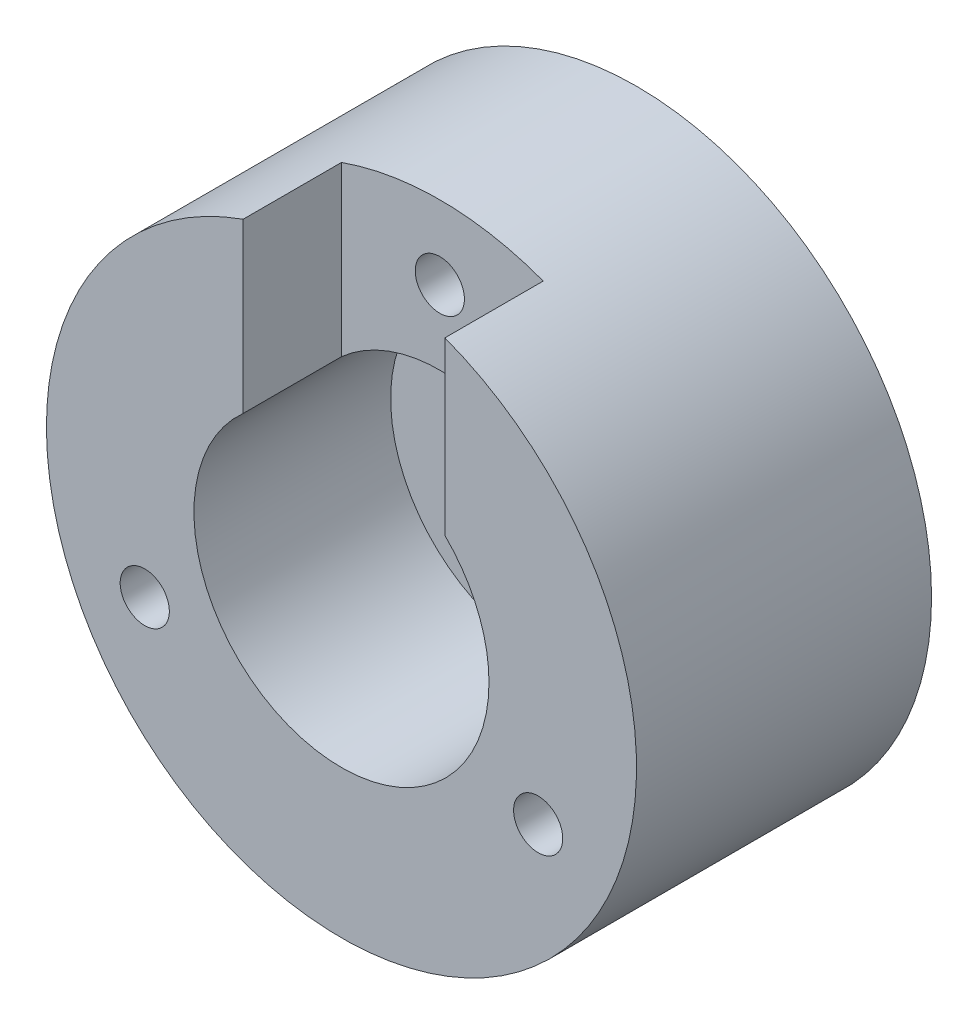
ISO-10303-21;
HEADER;
FILE_DESCRIPTION(('STEP AP214'),'2;1');
FILE_NAME('part.step','',(''),(''),'','','');
FILE_SCHEMA(('AUTOMOTIVE_DESIGN { 1 0 10303 214 1 1 1 1 }'));
ENDSEC;
DATA;
#1=APPLICATION_CONTEXT('core data for automotive mechanical design processes');
#2=APPLICATION_PROTOCOL_DEFINITION('international standard','automotive_design',2000,#1);
#3=PRODUCT_CONTEXT('',#1,'mechanical');
#4=PRODUCT('Part','Part','',(#3));
#5=PRODUCT_RELATED_PRODUCT_CATEGORY('part','',(#4));
#6=PRODUCT_DEFINITION_FORMATION('','',#4);
#7=PRODUCT_DEFINITION_CONTEXT('part definition',#1,'design');
#8=PRODUCT_DEFINITION('design','',#6,#7);
#9=PRODUCT_DEFINITION_SHAPE('','',#8);
#10=(LENGTH_UNIT() NAMED_UNIT(*) SI_UNIT(.MILLI.,.METRE.));
#11=(NAMED_UNIT(*) PLANE_ANGLE_UNIT() SI_UNIT($,.RADIAN.));
#12=(NAMED_UNIT(*) SI_UNIT($,.STERADIAN.) SOLID_ANGLE_UNIT());
#13=UNCERTAINTY_MEASURE_WITH_UNIT(LENGTH_MEASURE(1.E-05),#10,'distance_accuracy_value','');
#14=(GEOMETRIC_REPRESENTATION_CONTEXT(3) GLOBAL_UNCERTAINTY_ASSIGNED_CONTEXT((#13)) GLOBAL_UNIT_ASSIGNED_CONTEXT((#10,
#11,#12)) REPRESENTATION_CONTEXT('',''));
#15=CARTESIAN_POINT('',(0.,0.,0.));
#16=DIRECTION('',(0.,0.,1.));
#17=DIRECTION('',(1.,0.,0.));
#18=AXIS2_PLACEMENT_3D('',#15,#16,#17);
#19=CARTESIAN_POINT('',(0.,45.,-40.));
#20=DIRECTION('',(0.,0.,1.));
#21=DIRECTION('',(1.,0.,0.));
#22=AXIS2_PLACEMENT_3D('',#19,#20,#21);
#23=CYLINDRICAL_SURFACE('',#22,5.);
#24=CARTESIAN_POINT('',(0.,45.,0.));
#25=DIRECTION('',(0.,0.,1.));
#26=DIRECTION('',(1.,0.,0.));
#27=AXIS2_PLACEMENT_3D('',#24,#25,#26);
#28=CIRCLE('',#27,5.);
#29=CARTESIAN_POINT('',(4.99999999999999,45.,0.));
#30=VERTEX_POINT('',#29);
#31=EDGE_CURVE('E114',#30,#30,#28,.T.);
#32=ORIENTED_EDGE('',*,*,#31,.F.);
#33=EDGE_LOOP('',(#32));
#34=FACE_BOUND('',#33,.T.);
#35=CARTESIAN_POINT('',(0.,45.,40.));
#36=DIRECTION('',(0.,0.,1.));
#37=DIRECTION('',(1.,0.,0.));
#38=AXIS2_PLACEMENT_3D('',#35,#36,#37);
#39=CIRCLE('',#38,5.);
#40=CARTESIAN_POINT('',(4.99999999999999,45.,40.));
#41=VERTEX_POINT('',#40);
#42=EDGE_CURVE('E37',#41,#41,#39,.F.);
#43=ORIENTED_EDGE('',*,*,#42,.F.);
#44=EDGE_LOOP('',(#43));
#45=FACE_BOUND('',#44,.T.);
#46=ADVANCED_FACE('F33',(#34,#45),#23,.F.);
#47=CARTESIAN_POINT('',(0.,0.,60.));
#48=DIRECTION('',(0.,0.,-1.));
#49=DIRECTION('',(-1.,0.,0.));
#50=AXIS2_PLACEMENT_3D('',#47,#48,#49);
#51=CYLINDRICAL_SURFACE('',#50,60.);
#52=CARTESIAN_POINT('',(0.,0.,60.));
#53=DIRECTION('',(0.,0.,1.));
#54=DIRECTION('',(1.,0.,0.));
#55=AXIS2_PLACEMENT_3D('',#52,#53,#54);
#56=CIRCLE('',#55,60.);
#57=CARTESIAN_POINT('',(-20.,56.5685424949238,60.));
#58=VERTEX_POINT('',#57);
#59=CARTESIAN_POINT('',(21.0287457104299,56.1942332792794,60.));
#60=VERTEX_POINT('',#59);
#61=EDGE_CURVE('E11',#58,#60,#56,.T.);
#62=ORIENTED_EDGE('',*,*,#61,.F.);
#63=DIRECTION('',(0.,0.,1.));
#64=VECTOR('',#63,1.);
#65=CARTESIAN_POINT('',(-20.,56.5685424949238,40.));
#66=LINE('',#65,#64);
#67=CARTESIAN_POINT('',(-20.,56.5685424949238,40.));
#68=VERTEX_POINT('',#67);
#69=EDGE_CURVE('E97',#68,#58,#66,.T.);
#70=ORIENTED_EDGE('',*,*,#69,.F.);
#71=CARTESIAN_POINT('',(0.,0.,40.));
#72=DIRECTION('',(0.,0.,1.));
#73=DIRECTION('',(1.,0.,0.));
#74=AXIS2_PLACEMENT_3D('',#71,#72,#73);
#75=CIRCLE('',#74,60.);
#76=CARTESIAN_POINT('',(21.0287457104299,56.1942332792794,40.));
#77=VERTEX_POINT('',#76);
#78=EDGE_CURVE('E56',#77,#68,#75,.T.);
#79=ORIENTED_EDGE('',*,*,#78,.F.);
#80=DIRECTION('',(0.,0.,1.));
#81=VECTOR('',#80,1.);
#82=CARTESIAN_POINT('',(21.0287457104299,56.1942332792794,40.));
#83=LINE('',#82,#81);
#84=EDGE_CURVE('E84',#77,#60,#83,.T.);
#85=ORIENTED_EDGE('',*,*,#84,.T.);
#86=EDGE_LOOP('',(#62,#70,#79,#85));
#87=FACE_BOUND('',#86,.T.);
#88=CARTESIAN_POINT('',(0.,0.,0.));
#89=DIRECTION('',(0.,0.,1.));
#90=DIRECTION('',(1.,0.,0.));
#91=AXIS2_PLACEMENT_3D('',#88,#89,#90);
#92=CIRCLE('',#91,60.);
#93=CARTESIAN_POINT('',(60.,0.,0.));
#94=VERTEX_POINT('',#93);
#95=EDGE_CURVE('E42',#94,#94,#92,.T.);
#96=ORIENTED_EDGE('',*,*,#95,.T.);
#97=EDGE_LOOP('',(#96));
#98=FACE_BOUND('',#97,.T.);
#99=ADVANCED_FACE('F35',(#87,#98),#51,.T.);
#100=CARTESIAN_POINT('',(0.,0.,60.));
#101=DIRECTION('',(0.,0.,1.));
#102=DIRECTION('',(1.,0.,0.));
#103=AXIS2_PLACEMENT_3D('',#100,#101,#102);
#104=PLANE('',#103);
#105=DIRECTION('',(0.,-1.,0.));
#106=VECTOR('',#105,1.);
#107=CARTESIAN_POINT('',(-20.,56.5685424949238,60.));
#108=LINE('',#107,#106);
#109=CARTESIAN_POINT('',(-20.,22.3606797749979,60.));
#110=VERTEX_POINT('',#109);
#111=EDGE_CURVE('E74',#58,#110,#108,.T.);
#112=ORIENTED_EDGE('',*,*,#111,.F.);
#113=ORIENTED_EDGE('',*,*,#61,.T.);
#114=DIRECTION('',(0.,1.,0.));
#115=VECTOR('',#114,1.);
#116=CARTESIAN_POINT('',(21.0287457104299,56.1942332792794,60.));
#117=LINE('',#116,#115);
#118=CARTESIAN_POINT('',(21.0287457104299,21.3960709908636,60.));
#119=VERTEX_POINT('',#118);
#120=EDGE_CURVE('E256',#119,#60,#117,.T.);
#121=ORIENTED_EDGE('',*,*,#120,.F.);
#122=CARTESIAN_POINT('',(0.,0.,60.));
#123=DIRECTION('',(0.,0.,1.));
#124=DIRECTION('',(1.,0.,0.));
#125=AXIS2_PLACEMENT_3D('',#122,#123,#124);
#126=CIRCLE('',#125,30.);
#127=EDGE_CURVE('E95',#110,#119,#126,.T.);
#128=ORIENTED_EDGE('',*,*,#127,.F.);
#129=EDGE_LOOP('',(#112,#113,#121,#128));
#130=FACE_BOUND('',#129,.T.);
#131=CARTESIAN_POINT('',(40.,-20.,60.));
#132=DIRECTION('',(0.,0.,1.));
#133=DIRECTION('',(1.,0.,0.));
#134=AXIS2_PLACEMENT_3D('',#131,#132,#133);
#135=CIRCLE('',#134,5.);
#136=CARTESIAN_POINT('',(45.,-20.,60.));
#137=VERTEX_POINT('',#136);
#138=EDGE_CURVE('E102',#137,#137,#135,.T.);
#139=ORIENTED_EDGE('',*,*,#138,.F.);
#140=EDGE_LOOP('',(#139));
#141=FACE_BOUND('',#140,.T.);
#142=CARTESIAN_POINT('',(-40.,-20.,60.));
#143=DIRECTION('',(0.,0.,1.));
#144=DIRECTION('',(1.,0.,0.));
#145=AXIS2_PLACEMENT_3D('',#142,#143,#144);
#146=CIRCLE('',#145,5.);
#147=CARTESIAN_POINT('',(-35.,-20.,60.));
#148=VERTEX_POINT('',#147);
#149=EDGE_CURVE('E106',#148,#148,#146,.T.);
#150=ORIENTED_EDGE('',*,*,#149,.F.);
#151=EDGE_LOOP('',(#150));
#152=FACE_BOUND('',#151,.T.);
#153=ADVANCED_FACE('F153',(#130,#141,#152),#104,.T.);
#154=CARTESIAN_POINT('',(0.,0.,0.));
#155=DIRECTION('',(0.,0.,1.));
#156=DIRECTION('',(1.,0.,0.));
#157=AXIS2_PLACEMENT_3D('',#154,#155,#156);
#158=PLANE('',#157);
#159=CARTESIAN_POINT('',(40.,-20.,0.));
#160=DIRECTION('',(0.,0.,1.));
#161=DIRECTION('',(1.,0.,0.));
#162=AXIS2_PLACEMENT_3D('',#159,#160,#161);
#163=CIRCLE('',#162,5.);
#164=CARTESIAN_POINT('',(45.,-20.,0.));
#165=VERTEX_POINT('',#164);
#166=EDGE_CURVE('E105',#165,#165,#163,.T.);
#167=ORIENTED_EDGE('',*,*,#166,.T.);
#168=EDGE_LOOP('',(#167));
#169=FACE_BOUND('',#168,.T.);
#170=CARTESIAN_POINT('',(-40.,-20.,0.));
#171=DIRECTION('',(0.,0.,1.));
#172=DIRECTION('',(1.,0.,0.));
#173=AXIS2_PLACEMENT_3D('',#170,#171,#172);
#174=CIRCLE('',#173,5.);
#175=CARTESIAN_POINT('',(-35.,-20.,0.));
#176=VERTEX_POINT('',#175);
#177=EDGE_CURVE('E109',#176,#176,#174,.T.);
#178=ORIENTED_EDGE('',*,*,#177,.T.);
#179=EDGE_LOOP('',(#178));
#180=FACE_BOUND('',#179,.T.);
#181=ORIENTED_EDGE('',*,*,#31,.T.);
#182=EDGE_LOOP('',(#181));
#183=FACE_BOUND('',#182,.T.);
#184=CARTESIAN_POINT('',(0.,0.,0.));
#185=DIRECTION('',(0.,0.,1.));
#186=DIRECTION('',(1.,0.,0.));
#187=AXIS2_PLACEMENT_3D('',#184,#185,#186);
#188=CIRCLE('',#187,10.);
#189=CARTESIAN_POINT('',(10.,0.,0.));
#190=VERTEX_POINT('',#189);
#191=EDGE_CURVE('E113',#190,#190,#188,.T.);
#192=ORIENTED_EDGE('',*,*,#191,.T.);
#193=EDGE_LOOP('',(#192));
#194=FACE_BOUND('',#193,.T.);
#195=ORIENTED_EDGE('',*,*,#95,.F.);
#196=EDGE_LOOP('',(#195));
#197=FACE_BOUND('',#196,.T.);
#198=ADVANCED_FACE('F129',(#169,#180,#183,#194,#197),#158,.F.);
#199=CARTESIAN_POINT('',(0.,0.,20.));
#200=DIRECTION('',(0.,0.,1.));
#201=DIRECTION('',(1.,0.,0.));
#202=AXIS2_PLACEMENT_3D('',#199,#200,#201);
#203=CYLINDRICAL_SURFACE('',#202,30.);
#204=CARTESIAN_POINT('',(0.,0.,20.));
#205=DIRECTION('',(0.,0.,1.));
#206=DIRECTION('',(1.,0.,0.));
#207=AXIS2_PLACEMENT_3D('',#204,#205,#206);
#208=CIRCLE('',#207,30.);
#209=CARTESIAN_POINT('',(30.,0.,20.));
#210=VERTEX_POINT('',#209);
#211=EDGE_CURVE('E117',#210,#210,#208,.T.);
#212=ORIENTED_EDGE('',*,*,#211,.F.);
#213=EDGE_LOOP('',(#212));
#214=FACE_BOUND('',#213,.T.);
#215=CARTESIAN_POINT('',(0.,0.,40.));
#216=DIRECTION('',(0.,0.,-1.));
#217=DIRECTION('',(1.,0.,0.));
#218=AXIS2_PLACEMENT_3D('',#215,#216,#217);
#219=CIRCLE('',#218,30.);
#220=CARTESIAN_POINT('',(-20.,22.3606797749979,40.));
#221=VERTEX_POINT('',#220);
#222=CARTESIAN_POINT('',(21.0287457104299,21.3960709908636,40.));
#223=VERTEX_POINT('',#222);
#224=EDGE_CURVE('E85',#221,#223,#219,.T.);
#225=ORIENTED_EDGE('',*,*,#224,.F.);
#226=DIRECTION('',(0.,0.,1.));
#227=VECTOR('',#226,1.);
#228=CARTESIAN_POINT('',(-20.,22.3606797749979,40.));
#229=LINE('',#228,#227);
#230=EDGE_CURVE('E262',#221,#110,#229,.T.);
#231=ORIENTED_EDGE('',*,*,#230,.T.);
#232=ORIENTED_EDGE('',*,*,#127,.T.);
#233=DIRECTION('',(0.,0.,1.));
#234=VECTOR('',#233,1.);
#235=CARTESIAN_POINT('',(21.0287457104299,21.3960709908636,40.));
#236=LINE('',#235,#234);
#237=EDGE_CURVE('E81',#223,#119,#236,.T.);
#238=ORIENTED_EDGE('',*,*,#237,.F.);
#239=EDGE_LOOP('',(#225,#231,#232,#238));
#240=FACE_BOUND('',#239,.T.);
#241=ADVANCED_FACE('F93',(#214,#240),#203,.F.);
#242=CARTESIAN_POINT('',(0.,0.,20.));
#243=DIRECTION('',(0.,0.,1.));
#244=DIRECTION('',(1.,0.,0.));
#245=AXIS2_PLACEMENT_3D('',#242,#243,#244);
#246=PLANE('',#245);
#247=CARTESIAN_POINT('',(0.,0.,20.));
#248=DIRECTION('',(0.,0.,1.));
#249=DIRECTION('',(1.,0.,0.));
#250=AXIS2_PLACEMENT_3D('',#247,#248,#249);
#251=CIRCLE('',#250,10.);
#252=CARTESIAN_POINT('',(10.,0.,20.));
#253=VERTEX_POINT('',#252);
#254=EDGE_CURVE('E110',#253,#253,#251,.T.);
#255=ORIENTED_EDGE('',*,*,#254,.F.);
#256=EDGE_LOOP('',(#255));
#257=FACE_BOUND('',#256,.T.);
#258=ORIENTED_EDGE('',*,*,#211,.T.);
#259=EDGE_LOOP('',(#258));
#260=FACE_BOUND('',#259,.T.);
#261=ADVANCED_FACE('F160',(#257,#260),#246,.T.);
#262=CARTESIAN_POINT('',(0.,0.,-20.));
#263=DIRECTION('',(0.,0.,1.));
#264=DIRECTION('',(1.,0.,0.));
#265=AXIS2_PLACEMENT_3D('',#262,#263,#264);
#266=CYLINDRICAL_SURFACE('',#265,10.);
#267=ORIENTED_EDGE('',*,*,#254,.T.);
#268=EDGE_LOOP('',(#267));
#269=FACE_BOUND('',#268,.T.);
#270=ORIENTED_EDGE('',*,*,#191,.F.);
#271=EDGE_LOOP('',(#270));
#272=FACE_BOUND('',#271,.T.);
#273=ADVANCED_FACE('F143',(#269,#272),#266,.F.);
#274=CARTESIAN_POINT('',(-40.,-20.,-40.));
#275=DIRECTION('',(0.,0.,1.));
#276=DIRECTION('',(1.,0.,0.));
#277=AXIS2_PLACEMENT_3D('',#274,#275,#276);
#278=CYLINDRICAL_SURFACE('',#277,5.);
#279=ORIENTED_EDGE('',*,*,#149,.T.);
#280=EDGE_LOOP('',(#279));
#281=FACE_BOUND('',#280,.T.);
#282=ORIENTED_EDGE('',*,*,#177,.F.);
#283=EDGE_LOOP('',(#282));
#284=FACE_BOUND('',#283,.T.);
#285=ADVANCED_FACE('F134',(#281,#284),#278,.F.);
#286=CARTESIAN_POINT('',(40.,-20.,-40.));
#287=DIRECTION('',(0.,0.,1.));
#288=DIRECTION('',(1.,0.,0.));
#289=AXIS2_PLACEMENT_3D('',#286,#287,#288);
#290=CYLINDRICAL_SURFACE('',#289,5.);
#291=ORIENTED_EDGE('',*,*,#138,.T.);
#292=EDGE_LOOP('',(#291));
#293=FACE_BOUND('',#292,.T.);
#294=ORIENTED_EDGE('',*,*,#166,.F.);
#295=EDGE_LOOP('',(#294));
#296=FACE_BOUND('',#295,.T.);
#297=ADVANCED_FACE('F132',(#293,#296),#290,.F.);
#298=CARTESIAN_POINT('',(0.,0.,40.));
#299=DIRECTION('',(0.,0.,1.));
#300=DIRECTION('',(1.,0.,0.));
#301=AXIS2_PLACEMENT_3D('',#298,#299,#300);
#302=PLANE('',#301);
#303=ORIENTED_EDGE('',*,*,#224,.T.);
#304=DIRECTION('',(0.,1.,0.));
#305=VECTOR('',#304,1.);
#306=CARTESIAN_POINT('',(21.0287457104299,56.1942332792794,40.));
#307=LINE('',#306,#305);
#308=EDGE_CURVE('E78',#223,#77,#307,.T.);
#309=ORIENTED_EDGE('',*,*,#308,.T.);
#310=ORIENTED_EDGE('',*,*,#78,.T.);
#311=DIRECTION('',(0.,-1.,0.));
#312=VECTOR('',#311,1.);
#313=CARTESIAN_POINT('',(-20.,56.5685424949238,40.));
#314=LINE('',#313,#312);
#315=EDGE_CURVE('E50',#68,#221,#314,.T.);
#316=ORIENTED_EDGE('',*,*,#315,.T.);
#317=EDGE_LOOP('',(#303,#309,#310,#316));
#318=FACE_BOUND('',#317,.T.);
#319=ORIENTED_EDGE('',*,*,#42,.T.);
#320=EDGE_LOOP('',(#319));
#321=FACE_BOUND('',#320,.T.);
#322=ADVANCED_FACE('F88',(#318,#321),#302,.T.);
#323=CARTESIAN_POINT('',(-20.,56.5685424949238,40.));
#324=DIRECTION('',(-1.,0.,0.));
#325=DIRECTION('',(0.,-1.,0.));
#326=AXIS2_PLACEMENT_3D('',#323,#324,#325);
#327=PLANE('',#326);
#328=ORIENTED_EDGE('',*,*,#111,.T.);
#329=ORIENTED_EDGE('',*,*,#230,.F.);
#330=ORIENTED_EDGE('',*,*,#315,.F.);
#331=ORIENTED_EDGE('',*,*,#69,.T.);
#332=EDGE_LOOP('',(#328,#329,#330,#331));
#333=FACE_BOUND('',#332,.T.);
#334=ADVANCED_FACE('F141',(#333),#327,.F.);
#335=CARTESIAN_POINT('',(21.0287457104299,56.1942332792794,40.));
#336=DIRECTION('',(1.,0.,0.));
#337=DIRECTION('',(0.,0.,-1.));
#338=AXIS2_PLACEMENT_3D('',#335,#336,#337);
#339=PLANE('',#338);
#340=ORIENTED_EDGE('',*,*,#120,.T.);
#341=ORIENTED_EDGE('',*,*,#84,.F.);
#342=ORIENTED_EDGE('',*,*,#308,.F.);
#343=ORIENTED_EDGE('',*,*,#237,.T.);
#344=EDGE_LOOP('',(#340,#341,#342,#343));
#345=FACE_BOUND('',#344,.T.);
#346=ADVANCED_FACE('F79',(#345),#339,.F.);
#347=CLOSED_SHELL('',(#46,#99,#153,#198,#241,#261,#273,#285,#297,#322,#334,#346));
#348=MANIFOLD_SOLID_BREP('B2',#347);
#349=ADVANCED_BREP_SHAPE_REPRESENTATION('',(#18,#348),#14);
#350=SHAPE_DEFINITION_REPRESENTATION(#9,#349);
ENDSEC;
END-ISO-10303-21;
